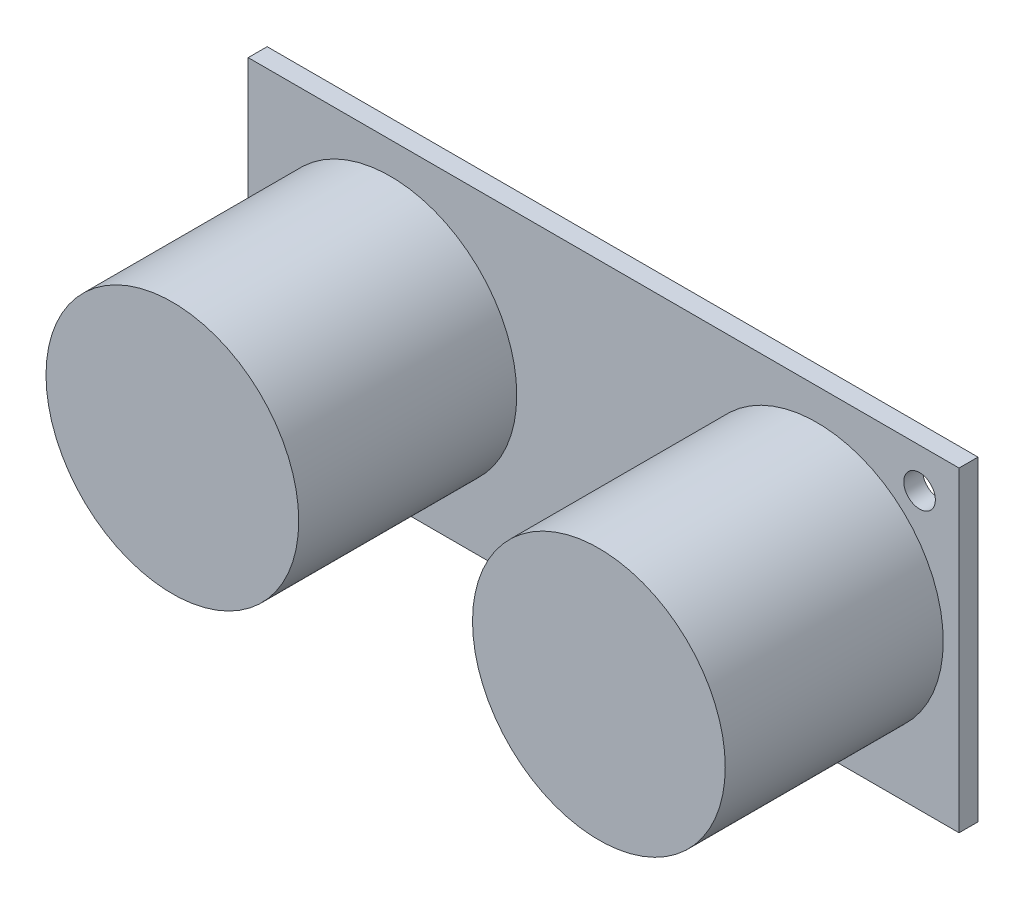
ISO-10303-21;
HEADER;
FILE_DESCRIPTION(('STEP AP214'),'2;1');
FILE_NAME('part.step','',(''),(''),'','','');
FILE_SCHEMA(('AUTOMOTIVE_DESIGN { 1 0 10303 214 1 1 1 1 }'));
ENDSEC;
DATA;
#1=APPLICATION_CONTEXT('core data for automotive mechanical design processes');
#2=APPLICATION_PROTOCOL_DEFINITION('international standard','automotive_design',2000,#1);
#3=PRODUCT_CONTEXT('',#1,'mechanical');
#4=PRODUCT('Part','Part','',(#3));
#5=PRODUCT_RELATED_PRODUCT_CATEGORY('part','',(#4));
#6=PRODUCT_DEFINITION_FORMATION('','',#4);
#7=PRODUCT_DEFINITION_CONTEXT('part definition',#1,'design');
#8=PRODUCT_DEFINITION('design','',#6,#7);
#9=PRODUCT_DEFINITION_SHAPE('','',#8);
#10=(LENGTH_UNIT() NAMED_UNIT(*) SI_UNIT(.MILLI.,.METRE.));
#11=(NAMED_UNIT(*) PLANE_ANGLE_UNIT() SI_UNIT($,.RADIAN.));
#12=(NAMED_UNIT(*) SI_UNIT($,.STERADIAN.) SOLID_ANGLE_UNIT());
#13=UNCERTAINTY_MEASURE_WITH_UNIT(LENGTH_MEASURE(1.E-05),#10,'distance_accuracy_value','');
#14=(GEOMETRIC_REPRESENTATION_CONTEXT(3) GLOBAL_UNCERTAINTY_ASSIGNED_CONTEXT((#13)) GLOBAL_UNIT_ASSIGNED_CONTEXT((#10,
#11,#12)) REPRESENTATION_CONTEXT('',''));
#15=CARTESIAN_POINT('',(0.,0.,0.));
#16=DIRECTION('',(0.,0.,1.));
#17=DIRECTION('',(1.,0.,0.));
#18=AXIS2_PLACEMENT_3D('',#15,#16,#17);
#19=CARTESIAN_POINT('',(0.,0.,1.2));
#20=DIRECTION('',(0.,0.,1.));
#21=DIRECTION('',(1.,0.,0.));
#22=AXIS2_PLACEMENT_3D('',#19,#20,#21);
#23=PLANE('',#22);
#24=CARTESIAN_POINT('',(-13.5,0.,1.2));
#25=DIRECTION('',(0.,0.,1.));
#26=DIRECTION('',(1.,0.,0.));
#27=AXIS2_PLACEMENT_3D('',#24,#25,#26);
#28=CIRCLE('',#27,8.);
#29=CARTESIAN_POINT('',(-5.5,0.,1.2));
#30=VERTEX_POINT('',#29);
#31=EDGE_CURVE('E154',#30,#30,#28,.T.);
#32=ORIENTED_EDGE('',*,*,#31,.F.);
#33=EDGE_LOOP('',(#32));
#34=FACE_BOUND('',#33,.T.);
#35=CARTESIAN_POINT('',(13.5,0.,1.2));
#36=DIRECTION('',(0.,0.,1.));
#37=DIRECTION('',(1.,0.,0.));
#38=AXIS2_PLACEMENT_3D('',#35,#36,#37);
#39=CIRCLE('',#38,8.);
#40=CARTESIAN_POINT('',(21.5,0.,1.2));
#41=VERTEX_POINT('',#40);
#42=EDGE_CURVE('E146',#41,#41,#39,.T.);
#43=ORIENTED_EDGE('',*,*,#42,.F.);
#44=EDGE_LOOP('',(#43));
#45=FACE_BOUND('',#44,.T.);
#46=CARTESIAN_POINT('',(20.,7.5,1.2));
#47=DIRECTION('',(0.,0.,1.));
#48=DIRECTION('',(1.,0.,0.));
#49=AXIS2_PLACEMENT_3D('',#46,#47,#48);
#50=CIRCLE('',#49,1.);
#51=CARTESIAN_POINT('',(21.,7.5,1.2));
#52=VERTEX_POINT('',#51);
#53=EDGE_CURVE('E112',#52,#52,#50,.T.);
#54=ORIENTED_EDGE('',*,*,#53,.F.);
#55=EDGE_LOOP('',(#54));
#56=FACE_BOUND('',#55,.T.);
#57=DIRECTION('',(0.,-1.,0.));
#58=VECTOR('',#57,1.);
#59=CARTESIAN_POINT('',(-22.5,10.,1.2));
#60=LINE('',#59,#58);
#61=CARTESIAN_POINT('',(-22.5,10.,1.2));
#62=VERTEX_POINT('',#61);
#63=CARTESIAN_POINT('',(-22.5,-10.,1.2));
#64=VERTEX_POINT('',#63);
#65=EDGE_CURVE('E92',#62,#64,#60,.T.);
#66=ORIENTED_EDGE('',*,*,#65,.T.);
#67=DIRECTION('',(1.,0.,0.));
#68=VECTOR('',#67,1.);
#69=CARTESIAN_POINT('',(-22.5,-10.,1.2));
#70=LINE('',#69,#68);
#71=CARTESIAN_POINT('',(22.5,-10.,1.2));
#72=VERTEX_POINT('',#71);
#73=EDGE_CURVE('E87',#64,#72,#70,.T.);
#74=ORIENTED_EDGE('',*,*,#73,.T.);
#75=DIRECTION('',(0.,1.,0.));
#76=VECTOR('',#75,1.);
#77=CARTESIAN_POINT('',(22.5,10.,1.2));
#78=LINE('',#77,#76);
#79=CARTESIAN_POINT('',(22.5,10.,1.2));
#80=VERTEX_POINT('',#79);
#81=EDGE_CURVE('E90',#72,#80,#78,.T.);
#82=ORIENTED_EDGE('',*,*,#81,.T.);
#83=DIRECTION('',(-1.,0.,0.));
#84=VECTOR('',#83,1.);
#85=CARTESIAN_POINT('',(-22.5,10.,1.2));
#86=LINE('',#85,#84);
#87=EDGE_CURVE('E57',#80,#62,#86,.T.);
#88=ORIENTED_EDGE('',*,*,#87,.T.);
#89=EDGE_LOOP('',(#66,#74,#82,#88));
#90=FACE_BOUND('',#89,.T.);
#91=CARTESIAN_POINT('',(-20.0000000000001,-7.49999999999986,1.2));
#92=DIRECTION('',(0.,0.,1.));
#93=DIRECTION('',(1.,0.,0.));
#94=AXIS2_PLACEMENT_3D('',#91,#92,#93);
#95=CIRCLE('',#94,1.);
#96=CARTESIAN_POINT('',(-19.0000000000001,-7.49999999999986,1.2));
#97=VERTEX_POINT('',#96);
#98=EDGE_CURVE('E134',#97,#97,#95,.T.);
#99=ORIENTED_EDGE('',*,*,#98,.F.);
#100=EDGE_LOOP('',(#99));
#101=FACE_BOUND('',#100,.T.);
#102=ADVANCED_FACE('F39',(#34,#45,#56,#90,#101),#23,.T.);
#103=CARTESIAN_POINT('',(0.,0.,0.));
#104=DIRECTION('',(0.,0.,1.));
#105=DIRECTION('',(1.,0.,0.));
#106=AXIS2_PLACEMENT_3D('',#103,#104,#105);
#107=PLANE('',#106);
#108=DIRECTION('',(0.,-1.,0.));
#109=VECTOR('',#108,1.);
#110=CARTESIAN_POINT('',(-22.5,10.,0.));
#111=LINE('',#110,#109);
#112=CARTESIAN_POINT('',(-22.5,10.,0.));
#113=VERTEX_POINT('',#112);
#114=CARTESIAN_POINT('',(-22.5,-10.,0.));
#115=VERTEX_POINT('',#114);
#116=EDGE_CURVE('E108',#113,#115,#111,.T.);
#117=ORIENTED_EDGE('',*,*,#116,.F.);
#118=DIRECTION('',(-1.,0.,0.));
#119=VECTOR('',#118,1.);
#120=CARTESIAN_POINT('',(-22.5,10.,0.));
#121=LINE('',#120,#119);
#122=CARTESIAN_POINT('',(22.5,10.,0.));
#123=VERTEX_POINT('',#122);
#124=EDGE_CURVE('E80',#123,#113,#121,.T.);
#125=ORIENTED_EDGE('',*,*,#124,.F.);
#126=DIRECTION('',(0.,1.,0.));
#127=VECTOR('',#126,1.);
#128=CARTESIAN_POINT('',(22.5,10.,0.));
#129=LINE('',#128,#127);
#130=CARTESIAN_POINT('',(22.5,-10.,0.));
#131=VERTEX_POINT('',#130);
#132=EDGE_CURVE('E74',#131,#123,#129,.T.);
#133=ORIENTED_EDGE('',*,*,#132,.F.);
#134=DIRECTION('',(1.,0.,0.));
#135=VECTOR('',#134,1.);
#136=CARTESIAN_POINT('',(-22.5,-10.,0.));
#137=LINE('',#136,#135);
#138=EDGE_CURVE('E97',#115,#131,#137,.T.);
#139=ORIENTED_EDGE('',*,*,#138,.F.);
#140=EDGE_LOOP('',(#117,#125,#133,#139));
#141=FACE_BOUND('',#140,.T.);
#142=CARTESIAN_POINT('',(20.,7.5,0.));
#143=DIRECTION('',(0.,0.,1.));
#144=DIRECTION('',(1.,0.,0.));
#145=AXIS2_PLACEMENT_3D('',#142,#143,#144);
#146=CIRCLE('',#145,1.);
#147=CARTESIAN_POINT('',(21.,7.5,0.));
#148=VERTEX_POINT('',#147);
#149=EDGE_CURVE('E130',#148,#148,#146,.T.);
#150=ORIENTED_EDGE('',*,*,#149,.T.);
#151=EDGE_LOOP('',(#150));
#152=FACE_BOUND('',#151,.T.);
#153=CARTESIAN_POINT('',(-20.0000000000001,-7.49999999999986,0.));
#154=DIRECTION('',(0.,0.,1.));
#155=DIRECTION('',(1.,0.,0.));
#156=AXIS2_PLACEMENT_3D('',#153,#154,#155);
#157=CIRCLE('',#156,1.);
#158=CARTESIAN_POINT('',(-19.0000000000001,-7.49999999999986,0.));
#159=VERTEX_POINT('',#158);
#160=EDGE_CURVE('E138',#159,#159,#157,.T.);
#161=ORIENTED_EDGE('',*,*,#160,.T.);
#162=EDGE_LOOP('',(#161));
#163=FACE_BOUND('',#162,.T.);
#164=ADVANCED_FACE('F125',(#141,#152,#163),#107,.F.);
#165=CARTESIAN_POINT('',(-22.5,10.,1.2));
#166=DIRECTION('',(1.,0.,0.));
#167=DIRECTION('',(0.,1.,0.));
#168=AXIS2_PLACEMENT_3D('',#165,#166,#167);
#169=PLANE('',#168);
#170=ORIENTED_EDGE('',*,*,#116,.T.);
#171=DIRECTION('',(0.,0.,-1.));
#172=VECTOR('',#171,1.);
#173=CARTESIAN_POINT('',(-22.5,-10.,1.2));
#174=LINE('',#173,#172);
#175=EDGE_CURVE('E11',#64,#115,#174,.T.);
#176=ORIENTED_EDGE('',*,*,#175,.F.);
#177=ORIENTED_EDGE('',*,*,#65,.F.);
#178=DIRECTION('',(0.,0.,-1.));
#179=VECTOR('',#178,1.);
#180=CARTESIAN_POINT('',(-22.5,10.,1.2));
#181=LINE('',#180,#179);
#182=EDGE_CURVE('E104',#62,#113,#181,.T.);
#183=ORIENTED_EDGE('',*,*,#182,.T.);
#184=EDGE_LOOP('',(#170,#176,#177,#183));
#185=FACE_BOUND('',#184,.T.);
#186=ADVANCED_FACE('F41',(#185),#169,.F.);
#187=CARTESIAN_POINT('',(-22.5,-10.,1.2));
#188=DIRECTION('',(0.,1.,0.));
#189=DIRECTION('',(0.,0.,1.));
#190=AXIS2_PLACEMENT_3D('',#187,#188,#189);
#191=PLANE('',#190);
#192=ORIENTED_EDGE('',*,*,#138,.T.);
#193=DIRECTION('',(0.,0.,-1.));
#194=VECTOR('',#193,1.);
#195=CARTESIAN_POINT('',(22.5,-10.,1.2));
#196=LINE('',#195,#194);
#197=EDGE_CURVE('E49',#72,#131,#196,.T.);
#198=ORIENTED_EDGE('',*,*,#197,.F.);
#199=ORIENTED_EDGE('',*,*,#73,.F.);
#200=ORIENTED_EDGE('',*,*,#175,.T.);
#201=EDGE_LOOP('',(#192,#198,#199,#200));
#202=FACE_BOUND('',#201,.T.);
#203=ADVANCED_FACE('F96',(#202),#191,.F.);
#204=CARTESIAN_POINT('',(22.5,10.,1.2));
#205=DIRECTION('',(-1.,0.,0.));
#206=DIRECTION('',(0.,0.,1.));
#207=AXIS2_PLACEMENT_3D('',#204,#205,#206);
#208=PLANE('',#207);
#209=ORIENTED_EDGE('',*,*,#132,.T.);
#210=DIRECTION('',(0.,0.,-1.));
#211=VECTOR('',#210,1.);
#212=CARTESIAN_POINT('',(22.5,10.,1.2));
#213=LINE('',#212,#211);
#214=EDGE_CURVE('E99',#80,#123,#213,.T.);
#215=ORIENTED_EDGE('',*,*,#214,.F.);
#216=ORIENTED_EDGE('',*,*,#81,.F.);
#217=ORIENTED_EDGE('',*,*,#197,.T.);
#218=EDGE_LOOP('',(#209,#215,#216,#217));
#219=FACE_BOUND('',#218,.T.);
#220=ADVANCED_FACE('F100',(#219),#208,.F.);
#221=CARTESIAN_POINT('',(-22.5,10.,1.2));
#222=DIRECTION('',(0.,-1.,0.));
#223=DIRECTION('',(0.,0.,-1.));
#224=AXIS2_PLACEMENT_3D('',#221,#222,#223);
#225=PLANE('',#224);
#226=ORIENTED_EDGE('',*,*,#124,.T.);
#227=ORIENTED_EDGE('',*,*,#182,.F.);
#228=ORIENTED_EDGE('',*,*,#87,.F.);
#229=ORIENTED_EDGE('',*,*,#214,.T.);
#230=EDGE_LOOP('',(#226,#227,#228,#229));
#231=FACE_BOUND('',#230,.T.);
#232=ADVANCED_FACE('F122',(#231),#225,.F.);
#233=CARTESIAN_POINT('',(20.,7.5,1.2));
#234=DIRECTION('',(0.,0.,-1.));
#235=DIRECTION('',(-1.,0.,0.));
#236=AXIS2_PLACEMENT_3D('',#233,#234,#235);
#237=CYLINDRICAL_SURFACE('',#236,1.);
#238=ORIENTED_EDGE('',*,*,#53,.T.);
#239=EDGE_LOOP('',(#238));
#240=FACE_BOUND('',#239,.T.);
#241=ORIENTED_EDGE('',*,*,#149,.F.);
#242=EDGE_LOOP('',(#241));
#243=FACE_BOUND('',#242,.T.);
#244=ADVANCED_FACE('F178',(#240,#243),#237,.F.);
#245=CARTESIAN_POINT('',(-20.0000000000001,-7.49999999999986,1.2));
#246=DIRECTION('',(0.,0.,-1.));
#247=DIRECTION('',(-1.,0.,0.));
#248=AXIS2_PLACEMENT_3D('',#245,#246,#247);
#249=CYLINDRICAL_SURFACE('',#248,1.);
#250=ORIENTED_EDGE('',*,*,#98,.T.);
#251=EDGE_LOOP('',(#250));
#252=FACE_BOUND('',#251,.T.);
#253=ORIENTED_EDGE('',*,*,#160,.F.);
#254=EDGE_LOOP('',(#253));
#255=FACE_BOUND('',#254,.T.);
#256=ADVANCED_FACE('F181',(#252,#255),#249,.F.);
#257=CARTESIAN_POINT('',(13.5,0.,15.));
#258=DIRECTION('',(0.,0.,-1.));
#259=DIRECTION('',(-1.,0.,0.));
#260=AXIS2_PLACEMENT_3D('',#257,#258,#259);
#261=CYLINDRICAL_SURFACE('',#260,8.);
#262=CARTESIAN_POINT('',(13.5,0.,15.));
#263=DIRECTION('',(0.,0.,1.));
#264=DIRECTION('',(1.,0.,0.));
#265=AXIS2_PLACEMENT_3D('',#262,#263,#264);
#266=CIRCLE('',#265,8.);
#267=CARTESIAN_POINT('',(21.5,0.,15.));
#268=VERTEX_POINT('',#267);
#269=EDGE_CURVE('E142',#268,#268,#266,.T.);
#270=ORIENTED_EDGE('',*,*,#269,.F.);
#271=EDGE_LOOP('',(#270));
#272=FACE_BOUND('',#271,.T.);
#273=ORIENTED_EDGE('',*,*,#42,.T.);
#274=EDGE_LOOP('',(#273));
#275=FACE_BOUND('',#274,.T.);
#276=ADVANCED_FACE('F190',(#272,#275),#261,.T.);
#277=CARTESIAN_POINT('',(13.5,0.,15.));
#278=DIRECTION('',(0.,0.,1.));
#279=DIRECTION('',(1.,0.,0.));
#280=AXIS2_PLACEMENT_3D('',#277,#278,#279);
#281=PLANE('',#280);
#282=ORIENTED_EDGE('',*,*,#269,.T.);
#283=EDGE_LOOP('',(#282));
#284=FACE_BOUND('',#283,.T.);
#285=ADVANCED_FACE('F167',(#284),#281,.T.);
#286=CARTESIAN_POINT('',(-13.5,0.,15.));
#287=DIRECTION('',(0.,0.,-1.));
#288=DIRECTION('',(-1.,0.,0.));
#289=AXIS2_PLACEMENT_3D('',#286,#287,#288);
#290=CYLINDRICAL_SURFACE('',#289,8.);
#291=CARTESIAN_POINT('',(-13.5,0.,15.));
#292=DIRECTION('',(0.,0.,1.));
#293=DIRECTION('',(1.,0.,0.));
#294=AXIS2_PLACEMENT_3D('',#291,#292,#293);
#295=CIRCLE('',#294,8.);
#296=CARTESIAN_POINT('',(-5.5,0.,15.));
#297=VERTEX_POINT('',#296);
#298=EDGE_CURVE('E150',#297,#297,#295,.T.);
#299=ORIENTED_EDGE('',*,*,#298,.F.);
#300=EDGE_LOOP('',(#299));
#301=FACE_BOUND('',#300,.T.);
#302=ORIENTED_EDGE('',*,*,#31,.T.);
#303=EDGE_LOOP('',(#302));
#304=FACE_BOUND('',#303,.T.);
#305=ADVANCED_FACE('F164',(#301,#304),#290,.T.);
#306=CARTESIAN_POINT('',(-13.5,0.,15.));
#307=DIRECTION('',(0.,0.,1.));
#308=DIRECTION('',(1.,0.,0.));
#309=AXIS2_PLACEMENT_3D('',#306,#307,#308);
#310=PLANE('',#309);
#311=ORIENTED_EDGE('',*,*,#298,.T.);
#312=EDGE_LOOP('',(#311));
#313=FACE_BOUND('',#312,.T.);
#314=ADVANCED_FACE('F162',(#313),#310,.T.);
#315=CLOSED_SHELL('',(#102,#164,#186,#203,#220,#232,#244,#256,#276,#285,#305,#314));
#316=MANIFOLD_SOLID_BREP('B2',#315);
#317=ADVANCED_BREP_SHAPE_REPRESENTATION('',(#18,#316),#14);
#318=SHAPE_DEFINITION_REPRESENTATION(#9,#317);
ENDSEC;
END-ISO-10303-21;
